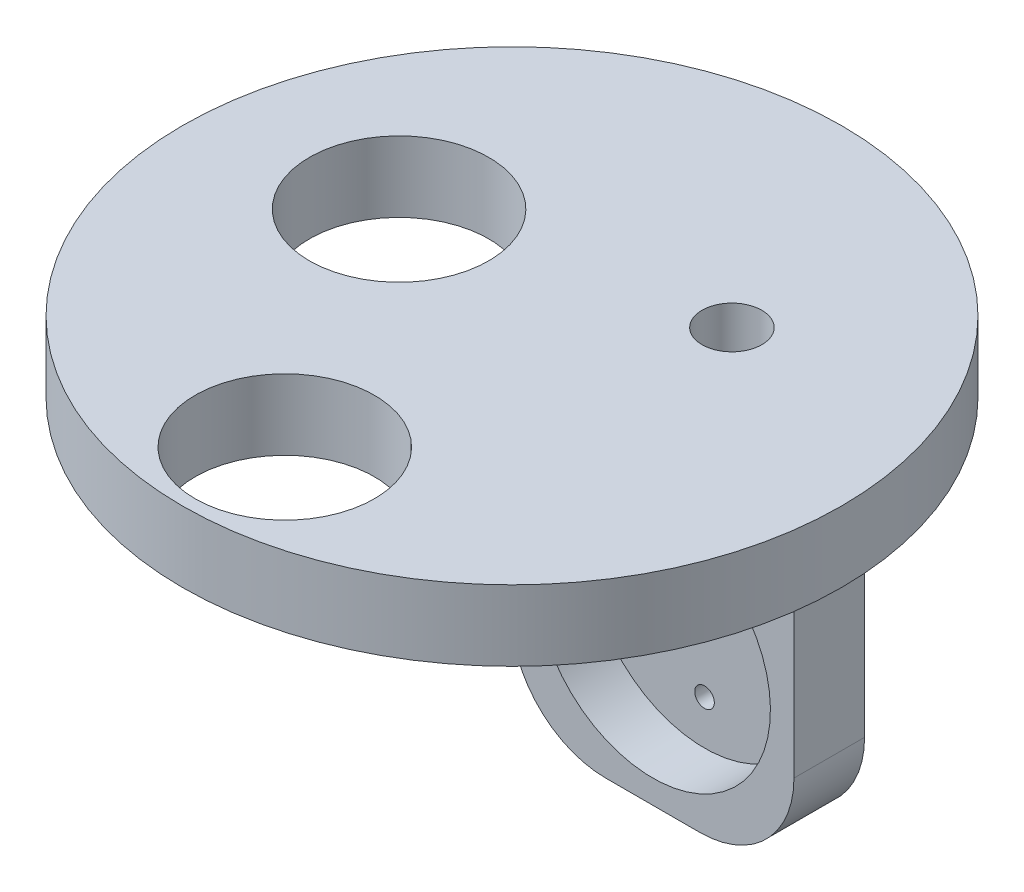
ISO-10303-21;
HEADER;
FILE_DESCRIPTION(('STEP AP214'),'2;1');
FILE_NAME('part.step','',(''),(''),'','','');
FILE_SCHEMA(('AUTOMOTIVE_DESIGN { 1 0 10303 214 1 1 1 1 }'));
ENDSEC;
DATA;
#1=APPLICATION_CONTEXT('core data for automotive mechanical design processes');
#2=APPLICATION_PROTOCOL_DEFINITION('international standard','automotive_design',2000,#1);
#3=PRODUCT_CONTEXT('',#1,'mechanical');
#4=PRODUCT('Part','Part','',(#3));
#5=PRODUCT_RELATED_PRODUCT_CATEGORY('part','',(#4));
#6=PRODUCT_DEFINITION_FORMATION('','',#4);
#7=PRODUCT_DEFINITION_CONTEXT('part definition',#1,'design');
#8=PRODUCT_DEFINITION('design','',#6,#7);
#9=PRODUCT_DEFINITION_SHAPE('','',#8);
#10=(LENGTH_UNIT() NAMED_UNIT(*) SI_UNIT(.MILLI.,.METRE.));
#11=(NAMED_UNIT(*) PLANE_ANGLE_UNIT() SI_UNIT($,.RADIAN.));
#12=(NAMED_UNIT(*) SI_UNIT($,.STERADIAN.) SOLID_ANGLE_UNIT());
#13=UNCERTAINTY_MEASURE_WITH_UNIT(LENGTH_MEASURE(1.E-05),#10,'distance_accuracy_value','');
#14=(GEOMETRIC_REPRESENTATION_CONTEXT(3) GLOBAL_UNCERTAINTY_ASSIGNED_CONTEXT((#13)) GLOBAL_UNIT_ASSIGNED_CONTEXT((#10,
#11,#12)) REPRESENTATION_CONTEXT('',''));
#15=CARTESIAN_POINT('',(0.,0.,0.));
#16=DIRECTION('',(0.,0.,1.));
#17=DIRECTION('',(1.,0.,0.));
#18=AXIS2_PLACEMENT_3D('',#15,#16,#17);
#19=CARTESIAN_POINT('',(15.,-22.5,7.5));
#20=DIRECTION('',(-1.,0.,0.));
#21=DIRECTION('',(0.,0.,1.));
#22=AXIS2_PLACEMENT_3D('',#19,#20,#21);
#23=PLANE('',#22);
#24=DIRECTION('',(0.,1.,0.));
#25=VECTOR('',#24,1.);
#26=CARTESIAN_POINT('',(15.,-22.5,7.5));
#27=LINE('',#26,#25);
#28=CARTESIAN_POINT('',(15.,-12.5,7.5));
#29=VERTEX_POINT('',#28);
#30=CARTESIAN_POINT('',(15.,22.5,7.5));
#31=VERTEX_POINT('',#30);
#32=EDGE_CURVE('E163',#29,#31,#27,.T.);
#33=ORIENTED_EDGE('',*,*,#32,.F.);
#34=DIRECTION('',(0.,0.,-1.));
#35=VECTOR('',#34,1.);
#36=CARTESIAN_POINT('',(15.,-12.5,7.5));
#37=LINE('',#36,#35);
#38=CARTESIAN_POINT('',(15.,-12.5,0.));
#39=VERTEX_POINT('',#38);
#40=EDGE_CURVE('E169',#29,#39,#37,.T.);
#41=ORIENTED_EDGE('',*,*,#40,.T.);
#42=DIRECTION('',(0.,1.,0.));
#43=VECTOR('',#42,1.);
#44=CARTESIAN_POINT('',(15.,-22.5,0.));
#45=LINE('',#44,#43);
#46=CARTESIAN_POINT('',(15.,22.5,0.));
#47=VERTEX_POINT('',#46);
#48=EDGE_CURVE('E152',#39,#47,#45,.T.);
#49=ORIENTED_EDGE('',*,*,#48,.T.);
#50=DIRECTION('',(0.,0.,-1.));
#51=VECTOR('',#50,1.);
#52=CARTESIAN_POINT('',(15.,22.5,7.5));
#53=LINE('',#52,#51);
#54=EDGE_CURVE('E166',#31,#47,#53,.T.);
#55=ORIENTED_EDGE('',*,*,#54,.F.);
#56=EDGE_LOOP('',(#33,#41,#49,#55));
#57=FACE_BOUND('',#56,.T.);
#58=ADVANCED_FACE('F35',(#57),#23,.F.);
#59=CARTESIAN_POINT('',(-15.,-22.5,7.5));
#60=DIRECTION('',(1.,0.,0.));
#61=DIRECTION('',(0.,0.,-1.));
#62=AXIS2_PLACEMENT_3D('',#59,#60,#61);
#63=PLANE('',#62);
#64=DIRECTION('',(0.,-1.,0.));
#65=VECTOR('',#64,1.);
#66=CARTESIAN_POINT('',(-15.,-22.5,0.));
#67=LINE('',#66,#65);
#68=CARTESIAN_POINT('',(-15.,22.5,0.));
#69=VERTEX_POINT('',#68);
#70=CARTESIAN_POINT('',(-15.,-12.5,0.));
#71=VERTEX_POINT('',#70);
#72=EDGE_CURVE('E150',#69,#71,#67,.T.);
#73=ORIENTED_EDGE('',*,*,#72,.T.);
#74=DIRECTION('',(0.,0.,-1.));
#75=VECTOR('',#74,1.);
#76=CARTESIAN_POINT('',(-15.,-12.5,7.5));
#77=LINE('',#76,#75);
#78=CARTESIAN_POINT('',(-15.,-12.5,7.5));
#79=VERTEX_POINT('',#78);
#80=EDGE_CURVE('E12',#71,#79,#77,.F.);
#81=ORIENTED_EDGE('',*,*,#80,.T.);
#82=DIRECTION('',(0.,-1.,0.));
#83=VECTOR('',#82,1.);
#84=CARTESIAN_POINT('',(-15.,-22.5,7.5));
#85=LINE('',#84,#83);
#86=CARTESIAN_POINT('',(-15.,22.5,7.5));
#87=VERTEX_POINT('',#86);
#88=EDGE_CURVE('E206',#87,#79,#85,.T.);
#89=ORIENTED_EDGE('',*,*,#88,.F.);
#90=DIRECTION('',(0.,0.,-1.));
#91=VECTOR('',#90,1.);
#92=CARTESIAN_POINT('',(-15.,22.5,7.5));
#93=LINE('',#92,#91);
#94=EDGE_CURVE('E164',#87,#69,#93,.T.);
#95=ORIENTED_EDGE('',*,*,#94,.T.);
#96=EDGE_LOOP('',(#73,#81,#89,#95));
#97=FACE_BOUND('',#96,.T.);
#98=ADVANCED_FACE('F205',(#97),#63,.F.);
#99=CARTESIAN_POINT('',(-15.,-22.5,7.5));
#100=DIRECTION('',(0.,1.,0.));
#101=DIRECTION('',(0.,0.,1.));
#102=AXIS2_PLACEMENT_3D('',#99,#100,#101);
#103=PLANE('',#102);
#104=DIRECTION('',(1.,0.,0.));
#105=VECTOR('',#104,1.);
#106=CARTESIAN_POINT('',(-15.,-22.5,0.));
#107=LINE('',#106,#105);
#108=CARTESIAN_POINT('',(-5.,-22.5,0.));
#109=VERTEX_POINT('',#108);
#110=CARTESIAN_POINT('',(5.,-22.5,0.));
#111=VERTEX_POINT('',#110);
#112=EDGE_CURVE('E160',#109,#111,#107,.T.);
#113=ORIENTED_EDGE('',*,*,#112,.T.);
#114=DIRECTION('',(0.,0.,-1.));
#115=VECTOR('',#114,1.);
#116=CARTESIAN_POINT('',(5.,-22.5,7.5));
#117=LINE('',#116,#115);
#118=CARTESIAN_POINT('',(5.,-22.5,7.5));
#119=VERTEX_POINT('',#118);
#120=EDGE_CURVE('E179',#111,#119,#117,.F.);
#121=ORIENTED_EDGE('',*,*,#120,.T.);
#122=DIRECTION('',(1.,0.,0.));
#123=VECTOR('',#122,1.);
#124=CARTESIAN_POINT('',(-15.,-22.5,7.5));
#125=LINE('',#124,#123);
#126=CARTESIAN_POINT('',(-5.,-22.5,7.5));
#127=VERTEX_POINT('',#126);
#128=EDGE_CURVE('E167',#127,#119,#125,.T.);
#129=ORIENTED_EDGE('',*,*,#128,.F.);
#130=DIRECTION('',(0.,0.,-1.));
#131=VECTOR('',#130,1.);
#132=CARTESIAN_POINT('',(-5.,-22.5,7.5));
#133=LINE('',#132,#131);
#134=EDGE_CURVE('E176',#127,#109,#133,.T.);
#135=ORIENTED_EDGE('',*,*,#134,.T.);
#136=EDGE_LOOP('',(#113,#121,#129,#135));
#137=FACE_BOUND('',#136,.T.);
#138=ADVANCED_FACE('F201',(#137),#103,.F.);
#139=CARTESIAN_POINT('',(0.,0.,7.5));
#140=DIRECTION('',(0.,0.,-1.));
#141=DIRECTION('',(-1.,0.,0.));
#142=AXIS2_PLACEMENT_3D('',#139,#140,#141);
#143=PLANE('',#142);
#144=DIRECTION('',(-1.,0.,0.));
#145=VECTOR('',#144,1.);
#146=CARTESIAN_POINT('',(-15.,22.5,7.5));
#147=LINE('',#146,#145);
#148=CARTESIAN_POINT('',(1.75,22.5,7.5));
#149=VERTEX_POINT('',#148);
#150=EDGE_CURVE('E208',#31,#149,#147,.T.);
#151=ORIENTED_EDGE('',*,*,#150,.T.);
#152=DIRECTION('',(0.,1.,0.));
#153=VECTOR('',#152,1.);
#154=CARTESIAN_POINT('',(1.75,27.,7.5));
#155=LINE('',#154,#153);
#156=CARTESIAN_POINT('',(1.75,4.87689379448657,7.5));
#157=VERTEX_POINT('',#156);
#158=EDGE_CURVE('E239',#157,#149,#155,.T.);
#159=ORIENTED_EDGE('',*,*,#158,.F.);
#160=CARTESIAN_POINT('',(0.,-7.5,7.5));
#161=DIRECTION('',(0.,0.,1.));
#162=DIRECTION('',(1.,0.,0.));
#163=AXIS2_PLACEMENT_3D('',#160,#161,#162);
#164=CIRCLE('',#163,12.5);
#165=CARTESIAN_POINT('',(-1.75,4.87689379448657,7.5));
#166=VERTEX_POINT('',#165);
#167=EDGE_CURVE('E214',#166,#157,#164,.T.);
#168=ORIENTED_EDGE('',*,*,#167,.F.);
#169=DIRECTION('',(0.,-1.,0.));
#170=VECTOR('',#169,1.);
#171=CARTESIAN_POINT('',(-1.75,27.,7.5));
#172=LINE('',#171,#170);
#173=CARTESIAN_POINT('',(-1.75,22.5,7.5));
#174=VERTEX_POINT('',#173);
#175=EDGE_CURVE('E50',#174,#166,#172,.T.);
#176=ORIENTED_EDGE('',*,*,#175,.F.);
#177=EDGE_CURVE('E131',#174,#87,#147,.T.);
#178=ORIENTED_EDGE('',*,*,#177,.T.);
#179=ORIENTED_EDGE('',*,*,#88,.T.);
#180=CARTESIAN_POINT('',(-5.,-12.5,7.5));
#181=DIRECTION('',(0.,0.,-1.));
#182=DIRECTION('',(-1.,0.,0.));
#183=AXIS2_PLACEMENT_3D('',#180,#181,#182);
#184=CIRCLE('',#183,10.);
#185=EDGE_CURVE('E181',#79,#127,#184,.F.);
#186=ORIENTED_EDGE('',*,*,#185,.T.);
#187=ORIENTED_EDGE('',*,*,#128,.T.);
#188=CARTESIAN_POINT('',(5.,-12.5,7.5));
#189=DIRECTION('',(0.,0.,-1.));
#190=DIRECTION('',(-1.,0.,0.));
#191=AXIS2_PLACEMENT_3D('',#188,#189,#190);
#192=CIRCLE('',#191,10.);
#193=EDGE_CURVE('E43',#119,#29,#192,.F.);
#194=ORIENTED_EDGE('',*,*,#193,.T.);
#195=ORIENTED_EDGE('',*,*,#32,.T.);
#196=EDGE_LOOP('',(#151,#159,#168,#176,#178,#179,#186,#187,#194,#195));
#197=FACE_BOUND('',#196,.T.);
#198=ADVANCED_FACE('F188',(#197),#143,.F.);
#199=CARTESIAN_POINT('',(0.,0.,0.));
#200=DIRECTION('',(0.,0.,-1.));
#201=DIRECTION('',(-1.,0.,0.));
#202=AXIS2_PLACEMENT_3D('',#199,#200,#201);
#203=PLANE('',#202);
#204=DIRECTION('',(0.,1.,0.));
#205=VECTOR('',#204,1.);
#206=CARTESIAN_POINT('',(1.75,27.,0.));
#207=LINE('',#206,#205);
#208=CARTESIAN_POINT('',(1.75,-7.5,0.));
#209=VERTEX_POINT('',#208);
#210=CARTESIAN_POINT('',(1.75,22.5,0.));
#211=VERTEX_POINT('',#210);
#212=EDGE_CURVE('E242',#209,#211,#207,.T.);
#213=ORIENTED_EDGE('',*,*,#212,.T.);
#214=DIRECTION('',(-1.,0.,0.));
#215=VECTOR('',#214,1.);
#216=CARTESIAN_POINT('',(-15.,22.5,0.));
#217=LINE('',#216,#215);
#218=EDGE_CURVE('E151',#47,#211,#217,.T.);
#219=ORIENTED_EDGE('',*,*,#218,.F.);
#220=ORIENTED_EDGE('',*,*,#48,.F.);
#221=CARTESIAN_POINT('',(5.,-12.5,0.));
#222=DIRECTION('',(0.,0.,-1.));
#223=DIRECTION('',(-1.,0.,0.));
#224=AXIS2_PLACEMENT_3D('',#221,#222,#223);
#225=CIRCLE('',#224,10.);
#226=EDGE_CURVE('E174',#39,#111,#225,.T.);
#227=ORIENTED_EDGE('',*,*,#226,.T.);
#228=ORIENTED_EDGE('',*,*,#112,.F.);
#229=CARTESIAN_POINT('',(-5.,-12.5,0.));
#230=DIRECTION('',(0.,0.,-1.));
#231=DIRECTION('',(-1.,0.,0.));
#232=AXIS2_PLACEMENT_3D('',#229,#230,#231);
#233=CIRCLE('',#232,10.);
#234=EDGE_CURVE('E172',#109,#71,#233,.T.);
#235=ORIENTED_EDGE('',*,*,#234,.T.);
#236=ORIENTED_EDGE('',*,*,#72,.F.);
#237=CARTESIAN_POINT('',(-1.75,22.5,0.));
#238=VERTEX_POINT('',#237);
#239=EDGE_CURVE('E128',#238,#69,#217,.T.);
#240=ORIENTED_EDGE('',*,*,#239,.F.);
#241=DIRECTION('',(0.,-1.,0.));
#242=VECTOR('',#241,1.);
#243=CARTESIAN_POINT('',(-1.75,27.,0.));
#244=LINE('',#243,#242);
#245=CARTESIAN_POINT('',(-1.75,-7.5,0.));
#246=VERTEX_POINT('',#245);
#247=EDGE_CURVE('E136',#238,#246,#244,.T.);
#248=ORIENTED_EDGE('',*,*,#247,.T.);
#249=DIRECTION('',(1.,0.,0.));
#250=VECTOR('',#249,1.);
#251=CARTESIAN_POINT('',(-1.75,-7.5,0.));
#252=LINE('',#251,#250);
#253=EDGE_CURVE('E244',#246,#209,#252,.T.);
#254=ORIENTED_EDGE('',*,*,#253,.T.);
#255=EDGE_LOOP('',(#213,#219,#220,#227,#228,#235,#236,#240,#248,#254));
#256=FACE_BOUND('',#255,.T.);
#257=CARTESIAN_POINT('',(0.,-15.30000099167,0.));
#258=DIRECTION('',(0.,0.,-1.));
#259=DIRECTION('',(-1.,0.,0.));
#260=AXIS2_PLACEMENT_3D('',#257,#258,#259);
#261=CIRCLE('',#260,1.03999900833002);
#262=CARTESIAN_POINT('',(-1.03999900833002,-15.30000099167,0.));
#263=VERTEX_POINT('',#262);
#264=EDGE_CURVE('E229',#263,#263,#261,.F.);
#265=ORIENTED_EDGE('',*,*,#264,.T.);
#266=EDGE_LOOP('',(#265));
#267=FACE_BOUND('',#266,.T.);
#268=CARTESIAN_POINT('',(6.75499900833002,-3.59999950416501,0.));
#269=DIRECTION('',(0.,0.,-1.));
#270=DIRECTION('',(-1.,0.,0.));
#271=AXIS2_PLACEMENT_3D('',#268,#269,#270);
#272=CIRCLE('',#271,1.03999900833002);
#273=CARTESIAN_POINT('',(5.715,-3.59999950416501,0.));
#274=VERTEX_POINT('',#273);
#275=EDGE_CURVE('E223',#274,#274,#272,.F.);
#276=ORIENTED_EDGE('',*,*,#275,.T.);
#277=EDGE_LOOP('',(#276));
#278=FACE_BOUND('',#277,.T.);
#279=CARTESIAN_POINT('',(-6.75499900833002,-3.59999950416501,0.));
#280=DIRECTION('',(0.,0.,-1.));
#281=DIRECTION('',(-1.,0.,0.));
#282=AXIS2_PLACEMENT_3D('',#279,#280,#281);
#283=CIRCLE('',#282,1.03999900833002);
#284=CARTESIAN_POINT('',(-7.79499801666004,-3.59999950416501,0.));
#285=VERTEX_POINT('',#284);
#286=EDGE_CURVE('E143',#285,#285,#283,.F.);
#287=ORIENTED_EDGE('',*,*,#286,.T.);
#288=EDGE_LOOP('',(#287));
#289=FACE_BOUND('',#288,.T.);
#290=ADVANCED_FACE('F148',(#256,#267,#278,#289),#203,.T.);
#291=CARTESIAN_POINT('',(0.,0.,2.));
#292=DIRECTION('',(0.,0.,-1.));
#293=DIRECTION('',(-1.,0.,0.));
#294=AXIS2_PLACEMENT_3D('',#291,#292,#293);
#295=PLANE('',#294);
#296=CARTESIAN_POINT('',(0.,-15.30000099167,2.));
#297=DIRECTION('',(0.,0.,1.));
#298=DIRECTION('',(1.,0.,0.));
#299=AXIS2_PLACEMENT_3D('',#296,#297,#298);
#300=CIRCLE('',#299,1.03999900833002);
#301=CARTESIAN_POINT('',(1.03999900833002,-15.30000099167,2.));
#302=VERTEX_POINT('',#301);
#303=EDGE_CURVE('E217',#302,#302,#300,.T.);
#304=ORIENTED_EDGE('',*,*,#303,.F.);
#305=EDGE_LOOP('',(#304));
#306=FACE_BOUND('',#305,.T.);
#307=CARTESIAN_POINT('',(6.75499900833002,-3.59999950416501,2.));
#308=DIRECTION('',(0.,0.,1.));
#309=DIRECTION('',(1.,0.,0.));
#310=AXIS2_PLACEMENT_3D('',#307,#308,#309);
#311=CIRCLE('',#310,1.03999900833002);
#312=CARTESIAN_POINT('',(7.79499801666004,-3.59999950416501,2.));
#313=VERTEX_POINT('',#312);
#314=EDGE_CURVE('E226',#313,#313,#311,.T.);
#315=ORIENTED_EDGE('',*,*,#314,.F.);
#316=EDGE_LOOP('',(#315));
#317=FACE_BOUND('',#316,.T.);
#318=CARTESIAN_POINT('',(-6.75499900833002,-3.59999950416501,2.));
#319=DIRECTION('',(0.,0.,1.));
#320=DIRECTION('',(1.,0.,0.));
#321=AXIS2_PLACEMENT_3D('',#318,#319,#320);
#322=CIRCLE('',#321,1.03999900833002);
#323=CARTESIAN_POINT('',(-5.715,-3.59999950416501,2.));
#324=VERTEX_POINT('',#323);
#325=EDGE_CURVE('E220',#324,#324,#322,.T.);
#326=ORIENTED_EDGE('',*,*,#325,.F.);
#327=EDGE_LOOP('',(#326));
#328=FACE_BOUND('',#327,.T.);
#329=CARTESIAN_POINT('',(0.,-7.5,2.));
#330=DIRECTION('',(0.,0.,-1.));
#331=DIRECTION('',(-1.,0.,0.));
#332=AXIS2_PLACEMENT_3D('',#329,#330,#331);
#333=CIRCLE('',#332,12.5);
#334=CARTESIAN_POINT('',(-1.75,4.87689379448656,2.));
#335=VERTEX_POINT('',#334);
#336=CARTESIAN_POINT('',(1.75,4.87689379448656,2.));
#337=VERTEX_POINT('',#336);
#338=EDGE_CURVE('E155',#335,#337,#333,.F.);
#339=ORIENTED_EDGE('',*,*,#338,.T.);
#340=DIRECTION('',(0.,1.,0.));
#341=VECTOR('',#340,1.);
#342=CARTESIAN_POINT('',(1.75,27.,2.));
#343=LINE('',#342,#341);
#344=CARTESIAN_POINT('',(1.75,-7.5,2.));
#345=VERTEX_POINT('',#344);
#346=EDGE_CURVE('E246',#345,#337,#343,.T.);
#347=ORIENTED_EDGE('',*,*,#346,.F.);
#348=DIRECTION('',(1.,0.,0.));
#349=VECTOR('',#348,1.);
#350=CARTESIAN_POINT('',(-1.75,-7.5,2.));
#351=LINE('',#350,#349);
#352=CARTESIAN_POINT('',(-1.75,-7.5,2.));
#353=VERTEX_POINT('',#352);
#354=EDGE_CURVE('E248',#353,#345,#351,.T.);
#355=ORIENTED_EDGE('',*,*,#354,.F.);
#356=DIRECTION('',(0.,-1.,0.));
#357=VECTOR('',#356,1.);
#358=CARTESIAN_POINT('',(-1.75,27.,2.));
#359=LINE('',#358,#357);
#360=EDGE_CURVE('E144',#335,#353,#359,.T.);
#361=ORIENTED_EDGE('',*,*,#360,.F.);
#362=EDGE_LOOP('',(#339,#347,#355,#361));
#363=FACE_BOUND('',#362,.T.);
#364=ADVANCED_FACE('F344',(#306,#317,#328,#363),#295,.F.);
#365=CARTESIAN_POINT('',(0.,-7.5,-35.3553390593274));
#366=DIRECTION('',(0.,0.,1.));
#367=DIRECTION('',(1.,0.,0.));
#368=AXIS2_PLACEMENT_3D('',#365,#366,#367);
#369=CYLINDRICAL_SURFACE('',#368,12.5);
#370=ORIENTED_EDGE('',*,*,#167,.T.);
#371=DIRECTION('',(0.,0.,1.));
#372=VECTOR('',#371,1.);
#373=CARTESIAN_POINT('',(1.75,4.87689379448656,-35.3553390593274));
#374=LINE('',#373,#372);
#375=EDGE_CURVE('E133',#337,#157,#374,.T.);
#376=ORIENTED_EDGE('',*,*,#375,.F.);
#377=ORIENTED_EDGE('',*,*,#338,.F.);
#378=DIRECTION('',(0.,0.,1.));
#379=VECTOR('',#378,1.);
#380=CARTESIAN_POINT('',(-1.75,4.87689379448656,-35.3553390593274));
#381=LINE('',#380,#379);
#382=EDGE_CURVE('E254',#166,#335,#381,.F.);
#383=ORIENTED_EDGE('',*,*,#382,.F.);
#384=EDGE_LOOP('',(#370,#376,#377,#383));
#385=FACE_BOUND('',#384,.T.);
#386=ADVANCED_FACE('F340',(#385),#369,.F.);
#387=CARTESIAN_POINT('',(-6.75499900833002,-3.59999950416501,-0.00100000000000013));
#388=DIRECTION('',(0.,0.,1.));
#389=DIRECTION('',(1.,0.,0.));
#390=AXIS2_PLACEMENT_3D('',#387,#388,#389);
#391=CYLINDRICAL_SURFACE('',#390,1.03999900833002);
#392=ORIENTED_EDGE('',*,*,#286,.F.);
#393=EDGE_LOOP('',(#392));
#394=FACE_BOUND('',#393,.T.);
#395=ORIENTED_EDGE('',*,*,#325,.T.);
#396=EDGE_LOOP('',(#395));
#397=FACE_BOUND('',#396,.T.);
#398=ADVANCED_FACE('F331',(#394,#397),#391,.F.);
#399=CARTESIAN_POINT('',(6.75499900833002,-3.59999950416501,-0.00100000000000013));
#400=DIRECTION('',(0.,0.,1.));
#401=DIRECTION('',(1.,0.,0.));
#402=AXIS2_PLACEMENT_3D('',#399,#400,#401);
#403=CYLINDRICAL_SURFACE('',#402,1.03999900833002);
#404=ORIENTED_EDGE('',*,*,#275,.F.);
#405=EDGE_LOOP('',(#404));
#406=FACE_BOUND('',#405,.T.);
#407=ORIENTED_EDGE('',*,*,#314,.T.);
#408=EDGE_LOOP('',(#407));
#409=FACE_BOUND('',#408,.T.);
#410=ADVANCED_FACE('F325',(#406,#409),#403,.F.);
#411=CARTESIAN_POINT('',(0.,-15.30000099167,-0.00100000000000013));
#412=DIRECTION('',(0.,0.,1.));
#413=DIRECTION('',(1.,0.,0.));
#414=AXIS2_PLACEMENT_3D('',#411,#412,#413);
#415=CYLINDRICAL_SURFACE('',#414,1.03999900833002);
#416=ORIENTED_EDGE('',*,*,#264,.F.);
#417=EDGE_LOOP('',(#416));
#418=FACE_BOUND('',#417,.T.);
#419=ORIENTED_EDGE('',*,*,#303,.T.);
#420=EDGE_LOOP('',(#419));
#421=FACE_BOUND('',#420,.T.);
#422=ADVANCED_FACE('F319',(#418,#421),#415,.F.);
#423=CARTESIAN_POINT('',(5.,-12.5,7.5));
#424=DIRECTION('',(0.,0.,-1.));
#425=DIRECTION('',(-1.,0.,0.));
#426=AXIS2_PLACEMENT_3D('',#423,#424,#425);
#427=CYLINDRICAL_SURFACE('',#426,10.);
#428=ORIENTED_EDGE('',*,*,#193,.F.);
#429=ORIENTED_EDGE('',*,*,#120,.F.);
#430=ORIENTED_EDGE('',*,*,#226,.F.);
#431=ORIENTED_EDGE('',*,*,#40,.F.);
#432=EDGE_LOOP('',(#428,#429,#430,#431));
#433=FACE_BOUND('',#432,.T.);
#434=ADVANCED_FACE('F197',(#433),#427,.T.);
#435=CARTESIAN_POINT('',(-5.,-12.5,7.5));
#436=DIRECTION('',(0.,0.,-1.));
#437=DIRECTION('',(-1.,0.,0.));
#438=AXIS2_PLACEMENT_3D('',#435,#436,#437);
#439=CYLINDRICAL_SURFACE('',#438,10.);
#440=ORIENTED_EDGE('',*,*,#185,.F.);
#441=ORIENTED_EDGE('',*,*,#80,.F.);
#442=ORIENTED_EDGE('',*,*,#234,.F.);
#443=ORIENTED_EDGE('',*,*,#134,.F.);
#444=EDGE_LOOP('',(#440,#441,#442,#443));
#445=FACE_BOUND('',#444,.T.);
#446=ADVANCED_FACE('F37',(#445),#439,.T.);
#447=CARTESIAN_POINT('',(1.75,27.,-0.00100000000000013));
#448=DIRECTION('',(1.,0.,0.));
#449=DIRECTION('',(0.,0.,-1.));
#450=AXIS2_PLACEMENT_3D('',#447,#448,#449);
#451=PLANE('',#450);
#452=DIRECTION('',(0.,0.,-1.));
#453=VECTOR('',#452,1.);
#454=CARTESIAN_POINT('',(1.75,22.5,-0.00100000000000013));
#455=LINE('',#454,#453);
#456=EDGE_CURVE('E132',#149,#211,#455,.T.);
#457=ORIENTED_EDGE('',*,*,#456,.T.);
#458=ORIENTED_EDGE('',*,*,#212,.F.);
#459=DIRECTION('',(0.,0.,1.));
#460=VECTOR('',#459,1.);
#461=CARTESIAN_POINT('',(1.75,-7.5,-0.00100000000000013));
#462=LINE('',#461,#460);
#463=EDGE_CURVE('E235',#209,#345,#462,.T.);
#464=ORIENTED_EDGE('',*,*,#463,.T.);
#465=ORIENTED_EDGE('',*,*,#346,.T.);
#466=ORIENTED_EDGE('',*,*,#375,.T.);
#467=ORIENTED_EDGE('',*,*,#158,.T.);
#468=EDGE_LOOP('',(#457,#458,#464,#465,#466,#467));
#469=FACE_BOUND('',#468,.T.);
#470=ADVANCED_FACE('F324',(#469),#451,.F.);
#471=CARTESIAN_POINT('',(-1.75,-7.5,-0.00100000000000013));
#472=DIRECTION('',(0.,-1.,0.));
#473=DIRECTION('',(0.,0.,-1.));
#474=AXIS2_PLACEMENT_3D('',#471,#472,#473);
#475=PLANE('',#474);
#476=DIRECTION('',(0.,0.,1.));
#477=VECTOR('',#476,1.);
#478=CARTESIAN_POINT('',(-1.75,-7.5,-0.00100000000000013));
#479=LINE('',#478,#477);
#480=EDGE_CURVE('E139',#246,#353,#479,.T.);
#481=ORIENTED_EDGE('',*,*,#480,.T.);
#482=ORIENTED_EDGE('',*,*,#354,.T.);
#483=ORIENTED_EDGE('',*,*,#463,.F.);
#484=ORIENTED_EDGE('',*,*,#253,.F.);
#485=EDGE_LOOP('',(#481,#482,#483,#484));
#486=FACE_BOUND('',#485,.T.);
#487=ADVANCED_FACE('F307',(#486),#475,.F.);
#488=CARTESIAN_POINT('',(-1.75,27.,-0.00100000000000013));
#489=DIRECTION('',(-1.,0.,0.));
#490=DIRECTION('',(0.,0.,1.));
#491=AXIS2_PLACEMENT_3D('',#488,#489,#490);
#492=PLANE('',#491);
#493=DIRECTION('',(0.,0.,1.));
#494=VECTOR('',#493,1.);
#495=CARTESIAN_POINT('',(-1.75,22.5,-0.00100000000000013));
#496=LINE('',#495,#494);
#497=EDGE_CURVE('E123',#238,#174,#496,.T.);
#498=ORIENTED_EDGE('',*,*,#497,.T.);
#499=ORIENTED_EDGE('',*,*,#175,.T.);
#500=ORIENTED_EDGE('',*,*,#382,.T.);
#501=ORIENTED_EDGE('',*,*,#360,.T.);
#502=ORIENTED_EDGE('',*,*,#480,.F.);
#503=ORIENTED_EDGE('',*,*,#247,.F.);
#504=EDGE_LOOP('',(#498,#499,#500,#501,#502,#503));
#505=FACE_BOUND('',#504,.T.);
#506=ADVANCED_FACE('F137',(#505),#492,.F.);
#507=CARTESIAN_POINT('',(0.,22.5,22.4499443206436));
#508=DIRECTION('',(0.,1.,0.));
#509=DIRECTION('',(0.,0.,1.));
#510=AXIS2_PLACEMENT_3D('',#507,#508,#509);
#511=PLANE('',#510);
#512=CARTESIAN_POINT('',(0.,22.5,46.5850667805285));
#513=DIRECTION('',(0.,1.,0.));
#514=DIRECTION('',(0.,0.,1.));
#515=AXIS2_PLACEMENT_3D('',#512,#513,#514);
#516=CIRCLE('',#515,9.52500000000001);
#517=CARTESIAN_POINT('',(0.,22.5,56.1100667805285));
#518=VERTEX_POINT('',#517);
#519=EDGE_CURVE('E260',#518,#518,#516,.F.);
#520=ORIENTED_EDGE('',*,*,#519,.F.);
#521=EDGE_LOOP('',(#520));
#522=FACE_BOUND('',#521,.T.);
#523=CARTESIAN_POINT('',(-15.8137702983634,22.5,18.6295688625769));
#524=DIRECTION('',(0.,1.,0.));
#525=DIRECTION('',(0.,0.,1.));
#526=AXIS2_PLACEMENT_3D('',#523,#524,#525);
#527=CIRCLE('',#526,9.52500000000001);
#528=CARTESIAN_POINT('',(-15.8137702983634,22.5,28.1545688625769));
#529=VERTEX_POINT('',#528);
#530=EDGE_CURVE('E270',#529,#529,#527,.F.);
#531=ORIENTED_EDGE('',*,*,#530,.F.);
#532=EDGE_LOOP('',(#531));
#533=FACE_BOUND('',#532,.T.);
#534=CARTESIAN_POINT('',(12.7538993087487,22.5,11.8443800679389));
#535=DIRECTION('',(0.,1.,0.));
#536=DIRECTION('',(0.,0.,1.));
#537=AXIS2_PLACEMENT_3D('',#534,#535,#536);
#538=CIRCLE('',#537,3.175);
#539=CARTESIAN_POINT('',(12.7538993087487,22.5,15.0193800679389));
#540=VERTEX_POINT('',#539);
#541=EDGE_CURVE('E263',#540,#540,#538,.F.);
#542=ORIENTED_EDGE('',*,*,#541,.F.);
#543=EDGE_LOOP('',(#542));
#544=FACE_BOUND('',#543,.T.);
#545=CARTESIAN_POINT('',(0.,22.5,22.4499443206436));
#546=DIRECTION('',(0.,1.,0.));
#547=DIRECTION('',(0.,0.,1.));
#548=AXIS2_PLACEMENT_3D('',#545,#546,#547);
#549=CIRCLE('',#548,35.);
#550=CARTESIAN_POINT('',(0.,22.5,57.4499443206437));
#551=VERTEX_POINT('',#550);
#552=EDGE_CURVE('E257',#551,#551,#549,.T.);
#553=ORIENTED_EDGE('',*,*,#552,.F.);
#554=EDGE_LOOP('',(#553));
#555=FACE_BOUND('',#554,.T.);
#556=ORIENTED_EDGE('',*,*,#239,.T.);
#557=ORIENTED_EDGE('',*,*,#94,.F.);
#558=ORIENTED_EDGE('',*,*,#177,.F.);
#559=ORIENTED_EDGE('',*,*,#497,.F.);
#560=EDGE_LOOP('',(#556,#557,#558,#559));
#561=FACE_BOUND('',#560,.T.);
#562=ORIENTED_EDGE('',*,*,#150,.F.);
#563=ORIENTED_EDGE('',*,*,#54,.T.);
#564=ORIENTED_EDGE('',*,*,#218,.T.);
#565=ORIENTED_EDGE('',*,*,#456,.F.);
#566=EDGE_LOOP('',(#562,#563,#564,#565));
#567=FACE_BOUND('',#566,.T.);
#568=ADVANCED_FACE('F125',(#522,#533,#544,#555,#561,#567),#511,.F.);
#569=CARTESIAN_POINT('',(0.,30.,22.4499443206436));
#570=DIRECTION('',(0.,-1.,0.));
#571=DIRECTION('',(0.,0.,-1.));
#572=AXIS2_PLACEMENT_3D('',#569,#570,#571);
#573=CYLINDRICAL_SURFACE('',#572,35.);
#574=CARTESIAN_POINT('',(0.,30.,22.4499443206436));
#575=DIRECTION('',(0.,1.,0.));
#576=DIRECTION('',(0.,0.,1.));
#577=AXIS2_PLACEMENT_3D('',#574,#575,#576);
#578=CIRCLE('',#577,35.);
#579=CARTESIAN_POINT('',(0.,30.,57.4499443206437));
#580=VERTEX_POINT('',#579);
#581=EDGE_CURVE('E256',#580,#580,#578,.T.);
#582=ORIENTED_EDGE('',*,*,#581,.F.);
#583=EDGE_LOOP('',(#582));
#584=FACE_BOUND('',#583,.T.);
#585=ORIENTED_EDGE('',*,*,#552,.T.);
#586=EDGE_LOOP('',(#585));
#587=FACE_BOUND('',#586,.T.);
#588=ADVANCED_FACE('F288',(#584,#587),#573,.T.);
#589=CARTESIAN_POINT('',(0.,30.,22.4499443206436));
#590=DIRECTION('',(0.,1.,0.));
#591=DIRECTION('',(0.,0.,1.));
#592=AXIS2_PLACEMENT_3D('',#589,#590,#591);
#593=PLANE('',#592);
#594=CARTESIAN_POINT('',(0.,30.,46.5850667805285));
#595=DIRECTION('',(0.,1.,0.));
#596=DIRECTION('',(0.,0.,1.));
#597=AXIS2_PLACEMENT_3D('',#594,#595,#596);
#598=CIRCLE('',#597,9.52500000000001);
#599=CARTESIAN_POINT('',(0.,30.,56.1100667805285));
#600=VERTEX_POINT('',#599);
#601=EDGE_CURVE('E273',#600,#600,#598,.T.);
#602=ORIENTED_EDGE('',*,*,#601,.F.);
#603=EDGE_LOOP('',(#602));
#604=FACE_BOUND('',#603,.T.);
#605=CARTESIAN_POINT('',(-15.8137702983634,30.,18.6295688625769));
#606=DIRECTION('',(0.,1.,0.));
#607=DIRECTION('',(0.,0.,1.));
#608=AXIS2_PLACEMENT_3D('',#605,#606,#607);
#609=CIRCLE('',#608,9.52500000000001);
#610=CARTESIAN_POINT('',(-15.8137702983634,30.,28.1545688625769));
#611=VERTEX_POINT('',#610);
#612=EDGE_CURVE('E266',#611,#611,#609,.T.);
#613=ORIENTED_EDGE('',*,*,#612,.F.);
#614=EDGE_LOOP('',(#613));
#615=FACE_BOUND('',#614,.T.);
#616=CARTESIAN_POINT('',(12.7538993087487,30.,11.8443800679389));
#617=DIRECTION('',(0.,1.,0.));
#618=DIRECTION('',(0.,0.,1.));
#619=AXIS2_PLACEMENT_3D('',#616,#617,#618);
#620=CIRCLE('',#619,3.175);
#621=CARTESIAN_POINT('',(12.7538993087487,30.,15.0193800679389));
#622=VERTEX_POINT('',#621);
#623=EDGE_CURVE('E267',#622,#622,#620,.T.);
#624=ORIENTED_EDGE('',*,*,#623,.F.);
#625=EDGE_LOOP('',(#624));
#626=FACE_BOUND('',#625,.T.);
#627=ORIENTED_EDGE('',*,*,#581,.T.);
#628=EDGE_LOOP('',(#627));
#629=FACE_BOUND('',#628,.T.);
#630=ADVANCED_FACE('F284',(#604,#615,#626,#629),#593,.T.);
#631=CARTESIAN_POINT('',(12.7538993087487,-22.501,11.8443800679389));
#632=DIRECTION('',(0.,1.,0.));
#633=DIRECTION('',(0.,0.,1.));
#634=AXIS2_PLACEMENT_3D('',#631,#632,#633);
#635=CYLINDRICAL_SURFACE('',#634,3.175);
#636=ORIENTED_EDGE('',*,*,#623,.T.);
#637=EDGE_LOOP('',(#636));
#638=FACE_BOUND('',#637,.T.);
#639=ORIENTED_EDGE('',*,*,#541,.T.);
#640=EDGE_LOOP('',(#639));
#641=FACE_BOUND('',#640,.T.);
#642=ADVANCED_FACE('F287',(#638,#641),#635,.F.);
#643=CARTESIAN_POINT('',(-15.8137702983634,-22.501,18.6295688625769));
#644=DIRECTION('',(0.,1.,0.));
#645=DIRECTION('',(0.,0.,1.));
#646=AXIS2_PLACEMENT_3D('',#643,#644,#645);
#647=CYLINDRICAL_SURFACE('',#646,9.52500000000001);
#648=ORIENTED_EDGE('',*,*,#612,.T.);
#649=EDGE_LOOP('',(#648));
#650=FACE_BOUND('',#649,.T.);
#651=ORIENTED_EDGE('',*,*,#530,.T.);
#652=EDGE_LOOP('',(#651));
#653=FACE_BOUND('',#652,.T.);
#654=ADVANCED_FACE('F438',(#650,#653),#647,.F.);
#655=CARTESIAN_POINT('',(0.,-22.501,46.5850667805285));
#656=DIRECTION('',(0.,1.,0.));
#657=DIRECTION('',(0.,0.,1.));
#658=AXIS2_PLACEMENT_3D('',#655,#656,#657);
#659=CYLINDRICAL_SURFACE('',#658,9.52500000000001);
#660=ORIENTED_EDGE('',*,*,#601,.T.);
#661=EDGE_LOOP('',(#660));
#662=FACE_BOUND('',#661,.T.);
#663=ORIENTED_EDGE('',*,*,#519,.T.);
#664=EDGE_LOOP('',(#663));
#665=FACE_BOUND('',#664,.T.);
#666=ADVANCED_FACE('F281',(#662,#665),#659,.F.);
#667=CLOSED_SHELL('',(#58,#98,#138,#198,#290,#364,#386,#398,#410,#422,#434,#446,#470,#487,#506,
#568,#588,#630,#642,#654,#666));
#668=MANIFOLD_SOLID_BREP('B2',#667);
#669=ADVANCED_BREP_SHAPE_REPRESENTATION('',(#18,#668),#14);
#670=SHAPE_DEFINITION_REPRESENTATION(#9,#669);
ENDSEC;
END-ISO-10303-21;
